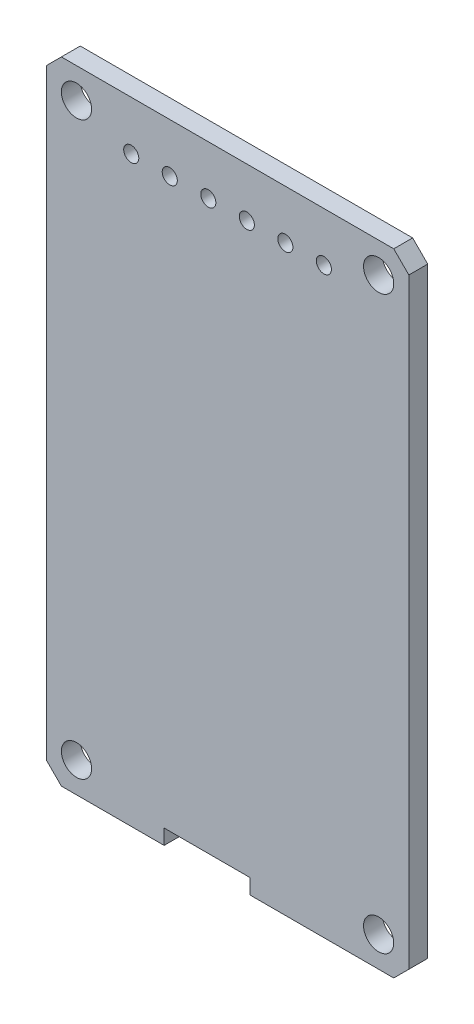
ISO-10303-21;
HEADER;
FILE_DESCRIPTION(('STEP AP214'),'2;1');
FILE_NAME('part.step','',(''),(''),'','','');
FILE_SCHEMA(('AUTOMOTIVE_DESIGN { 1 0 10303 214 1 1 1 1 }'));
ENDSEC;
DATA;
#1=APPLICATION_CONTEXT('core data for automotive mechanical design processes');
#2=APPLICATION_PROTOCOL_DEFINITION('international standard','automotive_design',2000,#1);
#3=PRODUCT_CONTEXT('',#1,'mechanical');
#4=PRODUCT('Part','Part','',(#3));
#5=PRODUCT_RELATED_PRODUCT_CATEGORY('part','',(#4));
#6=PRODUCT_DEFINITION_FORMATION('','',#4);
#7=PRODUCT_DEFINITION_CONTEXT('part definition',#1,'design');
#8=PRODUCT_DEFINITION('design','',#6,#7);
#9=PRODUCT_DEFINITION_SHAPE('','',#8);
#10=(LENGTH_UNIT() NAMED_UNIT(*) SI_UNIT(.MILLI.,.METRE.));
#11=(NAMED_UNIT(*) PLANE_ANGLE_UNIT() SI_UNIT($,.RADIAN.));
#12=(NAMED_UNIT(*) SI_UNIT($,.STERADIAN.) SOLID_ANGLE_UNIT());
#13=UNCERTAINTY_MEASURE_WITH_UNIT(LENGTH_MEASURE(1.E-05),#10,'distance_accuracy_value','');
#14=(GEOMETRIC_REPRESENTATION_CONTEXT(3) GLOBAL_UNCERTAINTY_ASSIGNED_CONTEXT((#13)) GLOBAL_UNIT_ASSIGNED_CONTEXT((#10,
#11,#12)) REPRESENTATION_CONTEXT('',''));
#15=CARTESIAN_POINT('',(0.,0.,0.));
#16=DIRECTION('',(0.,0.,1.));
#17=DIRECTION('',(1.,0.,0.));
#18=AXIS2_PLACEMENT_3D('',#15,#16,#17);
#19=CARTESIAN_POINT('',(0.,0.,0.));
#20=DIRECTION('',(0.,0.,1.));
#21=DIRECTION('',(1.,0.,0.));
#22=AXIS2_PLACEMENT_3D('',#19,#20,#21);
#23=PLANE('',#22);
#24=CARTESIAN_POINT('',(10.,2.,0.));
#25=DIRECTION('',(0.,0.,1.));
#26=DIRECTION('',(1.,0.,0.));
#27=AXIS2_PLACEMENT_3D('',#24,#25,#26);
#28=CIRCLE('',#27,1.);
#29=CARTESIAN_POINT('',(11.,2.,0.));
#30=VERTEX_POINT('',#29);
#31=EDGE_CURVE('E157',#30,#30,#28,.T.);
#32=ORIENTED_EDGE('',*,*,#31,.T.);
#33=EDGE_LOOP('',(#32));
#34=FACE_BOUND('',#33,.T.);
#35=CARTESIAN_POINT('',(1.275,38.55,0.));
#36=DIRECTION('',(0.,0.,1.));
#37=DIRECTION('',(1.,0.,0.));
#38=AXIS2_PLACEMENT_3D('',#35,#36,#37);
#39=CIRCLE('',#38,0.5);
#40=CARTESIAN_POINT('',(1.775,38.55,0.));
#41=VERTEX_POINT('',#40);
#42=EDGE_CURVE('E161',#41,#41,#39,.T.);
#43=ORIENTED_EDGE('',*,*,#42,.T.);
#44=EDGE_LOOP('',(#43));
#45=FACE_BOUND('',#44,.T.);
#46=CARTESIAN_POINT('',(-1.275,38.55,0.));
#47=DIRECTION('',(0.,0.,-1.));
#48=DIRECTION('',(-1.,0.,0.));
#49=AXIS2_PLACEMENT_3D('',#46,#47,#48);
#50=CIRCLE('',#49,0.5);
#51=CARTESIAN_POINT('',(-1.775,38.55,0.));
#52=VERTEX_POINT('',#51);
#53=EDGE_CURVE('E164',#52,#52,#50,.F.);
#54=ORIENTED_EDGE('',*,*,#53,.T.);
#55=EDGE_LOOP('',(#54));
#56=FACE_BOUND('',#55,.T.);
#57=CARTESIAN_POINT('',(-10.,2.,0.));
#58=DIRECTION('',(0.,0.,-1.));
#59=DIRECTION('',(-1.,0.,0.));
#60=AXIS2_PLACEMENT_3D('',#57,#58,#59);
#61=CIRCLE('',#60,1.);
#62=CARTESIAN_POINT('',(-11.,2.,0.));
#63=VERTEX_POINT('',#62);
#64=EDGE_CURVE('E167',#63,#63,#61,.F.);
#65=ORIENTED_EDGE('',*,*,#64,.T.);
#66=EDGE_LOOP('',(#65));
#67=FACE_BOUND('',#66,.T.);
#68=CARTESIAN_POINT('',(-10.,39.8,0.));
#69=DIRECTION('',(0.,0.,-1.));
#70=DIRECTION('',(-1.,0.,0.));
#71=AXIS2_PLACEMENT_3D('',#68,#69,#70);
#72=CIRCLE('',#71,1.);
#73=CARTESIAN_POINT('',(-11.,39.8,0.));
#74=VERTEX_POINT('',#73);
#75=EDGE_CURVE('E170',#74,#74,#72,.F.);
#76=ORIENTED_EDGE('',*,*,#75,.T.);
#77=EDGE_LOOP('',(#76));
#78=FACE_BOUND('',#77,.T.);
#79=CARTESIAN_POINT('',(-3.825,38.55,0.));
#80=DIRECTION('',(0.,0.,-1.));
#81=DIRECTION('',(-1.,0.,0.));
#82=AXIS2_PLACEMENT_3D('',#79,#80,#81);
#83=CIRCLE('',#82,0.5);
#84=CARTESIAN_POINT('',(-4.325,38.55,0.));
#85=VERTEX_POINT('',#84);
#86=EDGE_CURVE('E173',#85,#85,#83,.F.);
#87=ORIENTED_EDGE('',*,*,#86,.T.);
#88=EDGE_LOOP('',(#87));
#89=FACE_BOUND('',#88,.T.);
#90=CARTESIAN_POINT('',(-6.375,38.55,0.));
#91=DIRECTION('',(0.,0.,-1.));
#92=DIRECTION('',(-1.,0.,0.));
#93=AXIS2_PLACEMENT_3D('',#90,#91,#92);
#94=CIRCLE('',#93,0.5);
#95=CARTESIAN_POINT('',(-6.875,38.55,0.));
#96=VERTEX_POINT('',#95);
#97=EDGE_CURVE('E176',#96,#96,#94,.F.);
#98=ORIENTED_EDGE('',*,*,#97,.T.);
#99=EDGE_LOOP('',(#98));
#100=FACE_BOUND('',#99,.T.);
#101=CARTESIAN_POINT('',(3.825,38.55,0.));
#102=DIRECTION('',(0.,0.,1.));
#103=DIRECTION('',(1.,0.,0.));
#104=AXIS2_PLACEMENT_3D('',#101,#102,#103);
#105=CIRCLE('',#104,0.5);
#106=CARTESIAN_POINT('',(4.325,38.55,0.));
#107=VERTEX_POINT('',#106);
#108=EDGE_CURVE('E179',#107,#107,#105,.T.);
#109=ORIENTED_EDGE('',*,*,#108,.T.);
#110=EDGE_LOOP('',(#109));
#111=FACE_BOUND('',#110,.T.);
#112=CARTESIAN_POINT('',(10.,39.8,0.));
#113=DIRECTION('',(0.,0.,1.));
#114=DIRECTION('',(1.,0.,0.));
#115=AXIS2_PLACEMENT_3D('',#112,#113,#114);
#116=CIRCLE('',#115,1.);
#117=CARTESIAN_POINT('',(11.,39.8,0.));
#118=VERTEX_POINT('',#117);
#119=EDGE_CURVE('E181',#118,#118,#116,.T.);
#120=ORIENTED_EDGE('',*,*,#119,.T.);
#121=EDGE_LOOP('',(#120));
#122=FACE_BOUND('',#121,.T.);
#123=CARTESIAN_POINT('',(6.375,38.55,0.));
#124=DIRECTION('',(0.,0.,1.));
#125=DIRECTION('',(1.,0.,0.));
#126=AXIS2_PLACEMENT_3D('',#123,#124,#125);
#127=CIRCLE('',#126,0.5);
#128=CARTESIAN_POINT('',(6.875,38.55,0.));
#129=VERTEX_POINT('',#128);
#130=EDGE_CURVE('E20',#129,#129,#127,.T.);
#131=ORIENTED_EDGE('',*,*,#130,.T.);
#132=EDGE_LOOP('',(#131));
#133=FACE_BOUND('',#132,.T.);
#134=DIRECTION('',(1.,0.,0.));
#135=VECTOR('',#134,1.);
#136=CARTESIAN_POINT('',(1.5,1.,0.));
#137=LINE('',#136,#135);
#138=CARTESIAN_POINT('',(-4.2,1.,0.));
#139=VERTEX_POINT('',#138);
#140=CARTESIAN_POINT('',(1.5,1.,0.));
#141=VERTEX_POINT('',#140);
#142=EDGE_CURVE('E196',#139,#141,#137,.T.);
#143=ORIENTED_EDGE('',*,*,#142,.F.);
#144=DIRECTION('',(0.,1.,0.));
#145=VECTOR('',#144,1.);
#146=CARTESIAN_POINT('',(-4.2,1.,0.));
#147=LINE('',#146,#145);
#148=CARTESIAN_POINT('',(-4.2,0.,0.));
#149=VERTEX_POINT('',#148);
#150=EDGE_CURVE('E201',#149,#139,#147,.T.);
#151=ORIENTED_EDGE('',*,*,#150,.F.);
#152=DIRECTION('',(1.,0.,0.));
#153=VECTOR('',#152,1.);
#154=CARTESIAN_POINT('',(0.,0.,0.));
#155=LINE('',#154,#153);
#156=CARTESIAN_POINT('',(-11.,0.,0.));
#157=VERTEX_POINT('',#156);
#158=EDGE_CURVE('E208',#149,#157,#155,.F.);
#159=ORIENTED_EDGE('',*,*,#158,.T.);
#160=DIRECTION('',(-0.707106781186548,0.707106781186548,0.));
#161=VECTOR('',#160,1.);
#162=CARTESIAN_POINT('',(-12.,1.,0.));
#163=LINE('',#162,#161);
#164=CARTESIAN_POINT('',(-12.,1.,0.));
#165=VERTEX_POINT('',#164);
#166=EDGE_CURVE('E212',#157,#165,#163,.T.);
#167=ORIENTED_EDGE('',*,*,#166,.T.);
#168=DIRECTION('',(0.,1.,0.));
#169=VECTOR('',#168,1.);
#170=CARTESIAN_POINT('',(-12.,0.,0.));
#171=LINE('',#170,#169);
#172=CARTESIAN_POINT('',(-12.,40.8,0.));
#173=VERTEX_POINT('',#172);
#174=EDGE_CURVE('E216',#165,#173,#171,.T.);
#175=ORIENTED_EDGE('',*,*,#174,.T.);
#176=DIRECTION('',(-0.707106781186548,-0.707106781186548,0.));
#177=VECTOR('',#176,1.);
#178=CARTESIAN_POINT('',(-12.,40.8,0.));
#179=LINE('',#178,#177);
#180=CARTESIAN_POINT('',(-11.,41.8,0.));
#181=VERTEX_POINT('',#180);
#182=EDGE_CURVE('E218',#181,#173,#179,.T.);
#183=ORIENTED_EDGE('',*,*,#182,.F.);
#184=DIRECTION('',(1.,0.,0.));
#185=VECTOR('',#184,1.);
#186=CARTESIAN_POINT('',(-12.,41.8,0.));
#187=LINE('',#186,#185);
#188=CARTESIAN_POINT('',(11.,41.8,0.));
#189=VERTEX_POINT('',#188);
#190=EDGE_CURVE('E226',#181,#189,#187,.T.);
#191=ORIENTED_EDGE('',*,*,#190,.T.);
#192=DIRECTION('',(0.707106781186548,-0.707106781186548,0.));
#193=VECTOR('',#192,1.);
#194=CARTESIAN_POINT('',(12.,40.8,0.));
#195=LINE('',#194,#193);
#196=CARTESIAN_POINT('',(12.,40.8,0.));
#197=VERTEX_POINT('',#196);
#198=EDGE_CURVE('E230',#189,#197,#195,.T.);
#199=ORIENTED_EDGE('',*,*,#198,.T.);
#200=DIRECTION('',(0.,1.,0.));
#201=VECTOR('',#200,1.);
#202=CARTESIAN_POINT('',(12.,0.,0.));
#203=LINE('',#202,#201);
#204=CARTESIAN_POINT('',(12.,1.,0.));
#205=VERTEX_POINT('',#204);
#206=EDGE_CURVE('E103',#205,#197,#203,.T.);
#207=ORIENTED_EDGE('',*,*,#206,.F.);
#208=DIRECTION('',(0.707106781186548,0.707106781186548,0.));
#209=VECTOR('',#208,1.);
#210=CARTESIAN_POINT('',(12.,1.,0.));
#211=LINE('',#210,#209);
#212=CARTESIAN_POINT('',(11.,0.,0.));
#213=VERTEX_POINT('',#212);
#214=EDGE_CURVE('E118',#213,#205,#211,.T.);
#215=ORIENTED_EDGE('',*,*,#214,.F.);
#216=DIRECTION('',(1.,0.,0.));
#217=VECTOR('',#216,1.);
#218=CARTESIAN_POINT('',(0.,0.,0.));
#219=LINE('',#218,#217);
#220=CARTESIAN_POINT('',(1.5,0.,0.));
#221=VERTEX_POINT('',#220);
#222=EDGE_CURVE('E108',#213,#221,#219,.F.);
#223=ORIENTED_EDGE('',*,*,#222,.T.);
#224=DIRECTION('',(0.,1.,0.));
#225=VECTOR('',#224,1.);
#226=CARTESIAN_POINT('',(1.5,0.,0.));
#227=LINE('',#226,#225);
#228=EDGE_CURVE('E186',#141,#221,#227,.F.);
#229=ORIENTED_EDGE('',*,*,#228,.F.);
#230=EDGE_LOOP('',(#143,#151,#159,#167,#175,#183,#191,#199,#207,#215,#223,#229));
#231=FACE_BOUND('',#230,.T.);
#232=ADVANCED_FACE('F17',(#34,#45,#56,#67,#78,#89,#100,#111,#122,#133,#231),#23,.F.);
#233=CARTESIAN_POINT('',(0.,0.,0.));
#234=DIRECTION('',(0.,1.,0.));
#235=DIRECTION('',(0.,0.,1.));
#236=AXIS2_PLACEMENT_3D('',#233,#234,#235);
#237=PLANE('',#236);
#238=ORIENTED_EDGE('',*,*,#222,.F.);
#239=DIRECTION('',(0.,0.,1.));
#240=VECTOR('',#239,1.);
#241=CARTESIAN_POINT('',(11.,0.,-0.25));
#242=LINE('',#241,#240);
#243=CARTESIAN_POINT('',(11.,0.,1.25));
#244=VERTEX_POINT('',#243);
#245=EDGE_CURVE('E111',#244,#213,#242,.F.);
#246=ORIENTED_EDGE('',*,*,#245,.F.);
#247=DIRECTION('',(1.,0.,0.));
#248=VECTOR('',#247,1.);
#249=CARTESIAN_POINT('',(0.,0.,1.25));
#250=LINE('',#249,#248);
#251=CARTESIAN_POINT('',(1.5,0.,1.25));
#252=VERTEX_POINT('',#251);
#253=EDGE_CURVE('E160',#252,#244,#250,.T.);
#254=ORIENTED_EDGE('',*,*,#253,.F.);
#255=DIRECTION('',(0.,0.,1.));
#256=VECTOR('',#255,1.);
#257=CARTESIAN_POINT('',(1.5,0.,1.25));
#258=LINE('',#257,#256);
#259=EDGE_CURVE('E114',#221,#252,#258,.T.);
#260=ORIENTED_EDGE('',*,*,#259,.F.);
#261=EDGE_LOOP('',(#238,#246,#254,#260));
#262=FACE_BOUND('',#261,.T.);
#263=ADVANCED_FACE('F109',(#262),#237,.F.);
#264=CARTESIAN_POINT('',(12.,1.,-0.25));
#265=DIRECTION('',(0.707106781186548,-0.707106781186548,0.));
#266=DIRECTION('',(0.707106781186548,0.707106781186548,0.));
#267=AXIS2_PLACEMENT_3D('',#264,#265,#266);
#268=PLANE('',#267);
#269=ORIENTED_EDGE('',*,*,#214,.T.);
#270=DIRECTION('',(0.,0.,-1.));
#271=VECTOR('',#270,1.);
#272=CARTESIAN_POINT('',(12.,1.,0.));
#273=LINE('',#272,#271);
#274=CARTESIAN_POINT('',(12.,1.,1.25));
#275=VERTEX_POINT('',#274);
#276=EDGE_CURVE('E232',#275,#205,#273,.T.);
#277=ORIENTED_EDGE('',*,*,#276,.F.);
#278=DIRECTION('',(0.707106781186548,0.707106781186547,0.));
#279=VECTOR('',#278,1.);
#280=CARTESIAN_POINT('',(11.,0.,1.25));
#281=LINE('',#280,#279);
#282=EDGE_CURVE('E125',#244,#275,#281,.T.);
#283=ORIENTED_EDGE('',*,*,#282,.F.);
#284=ORIENTED_EDGE('',*,*,#245,.T.);
#285=EDGE_LOOP('',(#269,#277,#283,#284));
#286=FACE_BOUND('',#285,.T.);
#287=ADVANCED_FACE('F123',(#286),#268,.T.);
#288=CARTESIAN_POINT('',(12.,0.,0.));
#289=DIRECTION('',(1.,0.,0.));
#290=DIRECTION('',(0.,0.,-1.));
#291=AXIS2_PLACEMENT_3D('',#288,#289,#290);
#292=PLANE('',#291);
#293=DIRECTION('',(0.,1.,0.));
#294=VECTOR('',#293,1.);
#295=CARTESIAN_POINT('',(12.,0.,1.25));
#296=LINE('',#295,#294);
#297=CARTESIAN_POINT('',(12.,40.8,1.25));
#298=VERTEX_POINT('',#297);
#299=EDGE_CURVE('E249',#275,#298,#296,.T.);
#300=ORIENTED_EDGE('',*,*,#299,.F.);
#301=ORIENTED_EDGE('',*,*,#276,.T.);
#302=ORIENTED_EDGE('',*,*,#206,.T.);
#303=DIRECTION('',(0.,0.,1.));
#304=VECTOR('',#303,1.);
#305=CARTESIAN_POINT('',(12.,40.8,-0.25));
#306=LINE('',#305,#304);
#307=EDGE_CURVE('E228',#197,#298,#306,.T.);
#308=ORIENTED_EDGE('',*,*,#307,.T.);
#309=EDGE_LOOP('',(#300,#301,#302,#308));
#310=FACE_BOUND('',#309,.T.);
#311=ADVANCED_FACE('F236',(#310),#292,.T.);
#312=CARTESIAN_POINT('',(12.,40.8,-0.25));
#313=DIRECTION('',(-0.707106781186548,-0.707106781186548,0.));
#314=DIRECTION('',(0.707106781186548,-0.707106781186548,0.));
#315=AXIS2_PLACEMENT_3D('',#312,#313,#314);
#316=PLANE('',#315);
#317=ORIENTED_EDGE('',*,*,#198,.F.);
#318=DIRECTION('',(0.,0.,-1.));
#319=VECTOR('',#318,1.);
#320=CARTESIAN_POINT('',(11.,41.8,0.));
#321=LINE('',#320,#319);
#322=CARTESIAN_POINT('',(11.,41.8,1.25));
#323=VERTEX_POINT('',#322);
#324=EDGE_CURVE('E224',#189,#323,#321,.F.);
#325=ORIENTED_EDGE('',*,*,#324,.T.);
#326=DIRECTION('',(-0.707106781186547,0.707106781186547,0.));
#327=VECTOR('',#326,1.);
#328=CARTESIAN_POINT('',(12.,40.8,1.25));
#329=LINE('',#328,#327);
#330=EDGE_CURVE('E243',#298,#323,#329,.T.);
#331=ORIENTED_EDGE('',*,*,#330,.F.);
#332=ORIENTED_EDGE('',*,*,#307,.F.);
#333=EDGE_LOOP('',(#317,#325,#331,#332));
#334=FACE_BOUND('',#333,.T.);
#335=ADVANCED_FACE('F240',(#334),#316,.F.);
#336=CARTESIAN_POINT('',(-12.,41.8,0.));
#337=DIRECTION('',(0.,-1.,0.));
#338=DIRECTION('',(0.,0.,-1.));
#339=AXIS2_PLACEMENT_3D('',#336,#337,#338);
#340=PLANE('',#339);
#341=DIRECTION('',(1.,0.,0.));
#342=VECTOR('',#341,1.);
#343=CARTESIAN_POINT('',(0.,41.8,1.25));
#344=LINE('',#343,#342);
#345=CARTESIAN_POINT('',(-11.,41.8,1.25));
#346=VERTEX_POINT('',#345);
#347=EDGE_CURVE('E248',#323,#346,#344,.F.);
#348=ORIENTED_EDGE('',*,*,#347,.F.);
#349=ORIENTED_EDGE('',*,*,#324,.F.);
#350=ORIENTED_EDGE('',*,*,#190,.F.);
#351=DIRECTION('',(0.,0.,1.));
#352=VECTOR('',#351,1.);
#353=CARTESIAN_POINT('',(-11.,41.8,-0.25));
#354=LINE('',#353,#352);
#355=EDGE_CURVE('E221',#346,#181,#354,.F.);
#356=ORIENTED_EDGE('',*,*,#355,.F.);
#357=EDGE_LOOP('',(#348,#349,#350,#356));
#358=FACE_BOUND('',#357,.T.);
#359=ADVANCED_FACE('F458',(#358),#340,.F.);
#360=CARTESIAN_POINT('',(-12.,40.8,-0.25));
#361=DIRECTION('',(-0.707106781186548,0.707106781186548,0.));
#362=DIRECTION('',(-0.707106781186548,-0.707106781186548,0.));
#363=AXIS2_PLACEMENT_3D('',#360,#361,#362);
#364=PLANE('',#363);
#365=ORIENTED_EDGE('',*,*,#182,.T.);
#366=DIRECTION('',(0.,0.,-1.));
#367=VECTOR('',#366,1.);
#368=CARTESIAN_POINT('',(-12.,40.8,0.));
#369=LINE('',#368,#367);
#370=CARTESIAN_POINT('',(-12.,40.8,1.25));
#371=VERTEX_POINT('',#370);
#372=EDGE_CURVE('E214',#173,#371,#369,.F.);
#373=ORIENTED_EDGE('',*,*,#372,.T.);
#374=DIRECTION('',(-0.707106781186547,-0.707106781186547,0.));
#375=VECTOR('',#374,1.);
#376=CARTESIAN_POINT('',(-11.,41.8,1.25));
#377=LINE('',#376,#375);
#378=EDGE_CURVE('E256',#346,#371,#377,.T.);
#379=ORIENTED_EDGE('',*,*,#378,.F.);
#380=ORIENTED_EDGE('',*,*,#355,.T.);
#381=EDGE_LOOP('',(#365,#373,#379,#380));
#382=FACE_BOUND('',#381,.T.);
#383=ADVANCED_FACE('F449',(#382),#364,.T.);
#384=CARTESIAN_POINT('',(-12.,0.,0.));
#385=DIRECTION('',(1.,0.,0.));
#386=DIRECTION('',(0.,0.,-1.));
#387=AXIS2_PLACEMENT_3D('',#384,#385,#386);
#388=PLANE('',#387);
#389=DIRECTION('',(0.,1.,0.));
#390=VECTOR('',#389,1.);
#391=CARTESIAN_POINT('',(-12.,0.,1.25));
#392=LINE('',#391,#390);
#393=CARTESIAN_POINT('',(-12.,1.,1.25));
#394=VERTEX_POINT('',#393);
#395=EDGE_CURVE('E259',#371,#394,#392,.F.);
#396=ORIENTED_EDGE('',*,*,#395,.F.);
#397=ORIENTED_EDGE('',*,*,#372,.F.);
#398=ORIENTED_EDGE('',*,*,#174,.F.);
#399=DIRECTION('',(0.,0.,1.));
#400=VECTOR('',#399,1.);
#401=CARTESIAN_POINT('',(-12.,1.,-0.25));
#402=LINE('',#401,#400);
#403=EDGE_CURVE('E210',#165,#394,#402,.T.);
#404=ORIENTED_EDGE('',*,*,#403,.T.);
#405=EDGE_LOOP('',(#396,#397,#398,#404));
#406=FACE_BOUND('',#405,.T.);
#407=ADVANCED_FACE('F440',(#406),#388,.F.);
#408=CARTESIAN_POINT('',(-12.,1.,-0.25));
#409=DIRECTION('',(0.707106781186548,0.707106781186548,0.));
#410=DIRECTION('',(-0.707106781186548,0.707106781186548,0.));
#411=AXIS2_PLACEMENT_3D('',#408,#409,#410);
#412=PLANE('',#411);
#413=ORIENTED_EDGE('',*,*,#166,.F.);
#414=DIRECTION('',(0.,0.,1.));
#415=VECTOR('',#414,1.);
#416=CARTESIAN_POINT('',(-11.,0.,0.));
#417=LINE('',#416,#415);
#418=CARTESIAN_POINT('',(-11.,0.,1.25));
#419=VERTEX_POINT('',#418);
#420=EDGE_CURVE('E206',#157,#419,#417,.T.);
#421=ORIENTED_EDGE('',*,*,#420,.T.);
#422=DIRECTION('',(0.707106781186548,-0.707106781186547,0.));
#423=VECTOR('',#422,1.);
#424=CARTESIAN_POINT('',(-12.,1.,1.25));
#425=LINE('',#424,#423);
#426=EDGE_CURVE('E262',#394,#419,#425,.T.);
#427=ORIENTED_EDGE('',*,*,#426,.F.);
#428=ORIENTED_EDGE('',*,*,#403,.F.);
#429=EDGE_LOOP('',(#413,#421,#427,#428));
#430=FACE_BOUND('',#429,.T.);
#431=ADVANCED_FACE('F431',(#430),#412,.F.);
#432=CARTESIAN_POINT('',(0.,0.,0.));
#433=DIRECTION('',(0.,1.,0.));
#434=DIRECTION('',(0.,0.,1.));
#435=AXIS2_PLACEMENT_3D('',#432,#433,#434);
#436=PLANE('',#435);
#437=DIRECTION('',(1.,0.,0.));
#438=VECTOR('',#437,1.);
#439=CARTESIAN_POINT('',(0.,0.,1.25));
#440=LINE('',#439,#438);
#441=CARTESIAN_POINT('',(-4.2,0.,1.25));
#442=VERTEX_POINT('',#441);
#443=EDGE_CURVE('E265',#419,#442,#440,.T.);
#444=ORIENTED_EDGE('',*,*,#443,.F.);
#445=ORIENTED_EDGE('',*,*,#420,.F.);
#446=ORIENTED_EDGE('',*,*,#158,.F.);
#447=DIRECTION('',(0.,0.,-1.));
#448=VECTOR('',#447,1.);
#449=CARTESIAN_POINT('',(-4.2,0.,1.25));
#450=LINE('',#449,#448);
#451=EDGE_CURVE('E203',#442,#149,#450,.T.);
#452=ORIENTED_EDGE('',*,*,#451,.F.);
#453=EDGE_LOOP('',(#444,#445,#446,#452));
#454=FACE_BOUND('',#453,.T.);
#455=ADVANCED_FACE('F422',(#454),#436,.F.);
#456=CARTESIAN_POINT('',(-4.2,1.,1.25));
#457=DIRECTION('',(1.,0.,0.));
#458=DIRECTION('',(0.,0.,-1.));
#459=AXIS2_PLACEMENT_3D('',#456,#457,#458);
#460=PLANE('',#459);
#461=ORIENTED_EDGE('',*,*,#451,.T.);
#462=ORIENTED_EDGE('',*,*,#150,.T.);
#463=DIRECTION('',(0.,0.,-1.));
#464=VECTOR('',#463,1.);
#465=CARTESIAN_POINT('',(-4.2,1.,1.25));
#466=LINE('',#465,#464);
#467=CARTESIAN_POINT('',(-4.2,1.,1.25));
#468=VERTEX_POINT('',#467);
#469=EDGE_CURVE('E198',#468,#139,#466,.T.);
#470=ORIENTED_EDGE('',*,*,#469,.F.);
#471=DIRECTION('',(0.,1.,0.));
#472=VECTOR('',#471,1.);
#473=CARTESIAN_POINT('',(-4.2,0.,1.25));
#474=LINE('',#473,#472);
#475=EDGE_CURVE('E268',#442,#468,#474,.T.);
#476=ORIENTED_EDGE('',*,*,#475,.F.);
#477=EDGE_LOOP('',(#461,#462,#470,#476));
#478=FACE_BOUND('',#477,.T.);
#479=ADVANCED_FACE('F287',(#478),#460,.T.);
#480=CARTESIAN_POINT('',(1.5,1.,1.25));
#481=DIRECTION('',(0.,-1.,0.));
#482=DIRECTION('',(0.,0.,-1.));
#483=AXIS2_PLACEMENT_3D('',#480,#481,#482);
#484=PLANE('',#483);
#485=ORIENTED_EDGE('',*,*,#469,.T.);
#486=ORIENTED_EDGE('',*,*,#142,.T.);
#487=DIRECTION('',(0.,0.,1.));
#488=VECTOR('',#487,1.);
#489=CARTESIAN_POINT('',(1.5,1.,1.25));
#490=LINE('',#489,#488);
#491=CARTESIAN_POINT('',(1.5,1.,1.25));
#492=VERTEX_POINT('',#491);
#493=EDGE_CURVE('E35',#492,#141,#490,.F.);
#494=ORIENTED_EDGE('',*,*,#493,.F.);
#495=DIRECTION('',(1.,0.,0.));
#496=VECTOR('',#495,1.);
#497=CARTESIAN_POINT('',(0.,1.,1.25));
#498=LINE('',#497,#496);
#499=EDGE_CURVE('E271',#468,#492,#498,.T.);
#500=ORIENTED_EDGE('',*,*,#499,.F.);
#501=EDGE_LOOP('',(#485,#486,#494,#500));
#502=FACE_BOUND('',#501,.T.);
#503=ADVANCED_FACE('F277',(#502),#484,.T.);
#504=CARTESIAN_POINT('',(1.5,0.,1.25));
#505=DIRECTION('',(-1.,0.,0.));
#506=DIRECTION('',(0.,0.,1.));
#507=AXIS2_PLACEMENT_3D('',#504,#505,#506);
#508=PLANE('',#507);
#509=ORIENTED_EDGE('',*,*,#493,.T.);
#510=ORIENTED_EDGE('',*,*,#228,.T.);
#511=ORIENTED_EDGE('',*,*,#259,.T.);
#512=DIRECTION('',(0.,1.,0.));
#513=VECTOR('',#512,1.);
#514=CARTESIAN_POINT('',(1.5,0.,1.25));
#515=LINE('',#514,#513);
#516=EDGE_CURVE('E156',#492,#252,#515,.F.);
#517=ORIENTED_EDGE('',*,*,#516,.F.);
#518=EDGE_LOOP('',(#509,#510,#511,#517));
#519=FACE_BOUND('',#518,.T.);
#520=ADVANCED_FACE('F274',(#519),#508,.T.);
#521=CARTESIAN_POINT('',(6.375,38.55,1.25));
#522=DIRECTION('',(0.,0.,1.));
#523=DIRECTION('',(1.,0.,0.));
#524=AXIS2_PLACEMENT_3D('',#521,#522,#523);
#525=CYLINDRICAL_SURFACE('',#524,0.5);
#526=ORIENTED_EDGE('',*,*,#130,.F.);
#527=EDGE_LOOP('',(#526));
#528=FACE_BOUND('',#527,.T.);
#529=CARTESIAN_POINT('',(6.375,38.55,1.25));
#530=DIRECTION('',(0.,0.,1.));
#531=DIRECTION('',(1.,0.,0.));
#532=AXIS2_PLACEMENT_3D('',#529,#530,#531);
#533=CIRCLE('',#532,0.5);
#534=CARTESIAN_POINT('',(6.875,38.55,1.25));
#535=VERTEX_POINT('',#534);
#536=EDGE_CURVE('E153',#535,#535,#533,.F.);
#537=ORIENTED_EDGE('',*,*,#536,.F.);
#538=EDGE_LOOP('',(#537));
#539=FACE_BOUND('',#538,.T.);
#540=ADVANCED_FACE('F276',(#528,#539),#525,.F.);
#541=CARTESIAN_POINT('',(10.,39.8,1.25));
#542=DIRECTION('',(0.,0.,1.));
#543=DIRECTION('',(1.,0.,0.));
#544=AXIS2_PLACEMENT_3D('',#541,#542,#543);
#545=CYLINDRICAL_SURFACE('',#544,1.);
#546=ORIENTED_EDGE('',*,*,#119,.F.);
#547=EDGE_LOOP('',(#546));
#548=FACE_BOUND('',#547,.T.);
#549=CARTESIAN_POINT('',(10.,39.8,1.25));
#550=DIRECTION('',(0.,0.,1.));
#551=DIRECTION('',(1.,0.,0.));
#552=AXIS2_PLACEMENT_3D('',#549,#550,#551);
#553=CIRCLE('',#552,1.);
#554=CARTESIAN_POINT('',(11.,39.8,1.25));
#555=VERTEX_POINT('',#554);
#556=EDGE_CURVE('E150',#555,#555,#553,.F.);
#557=ORIENTED_EDGE('',*,*,#556,.F.);
#558=EDGE_LOOP('',(#557));
#559=FACE_BOUND('',#558,.T.);
#560=ADVANCED_FACE('F284',(#548,#559),#545,.F.);
#561=CARTESIAN_POINT('',(3.825,38.55,1.25));
#562=DIRECTION('',(0.,0.,1.));
#563=DIRECTION('',(1.,0.,0.));
#564=AXIS2_PLACEMENT_3D('',#561,#562,#563);
#565=CYLINDRICAL_SURFACE('',#564,0.5);
#566=ORIENTED_EDGE('',*,*,#108,.F.);
#567=EDGE_LOOP('',(#566));
#568=FACE_BOUND('',#567,.T.);
#569=CARTESIAN_POINT('',(3.825,38.55,1.25));
#570=DIRECTION('',(0.,0.,1.));
#571=DIRECTION('',(1.,0.,0.));
#572=AXIS2_PLACEMENT_3D('',#569,#570,#571);
#573=CIRCLE('',#572,0.5);
#574=CARTESIAN_POINT('',(4.325,38.55,1.25));
#575=VERTEX_POINT('',#574);
#576=EDGE_CURVE('E147',#575,#575,#573,.F.);
#577=ORIENTED_EDGE('',*,*,#576,.F.);
#578=EDGE_LOOP('',(#577));
#579=FACE_BOUND('',#578,.T.);
#580=ADVANCED_FACE('F323',(#568,#579),#565,.F.);
#581=CARTESIAN_POINT('',(-6.375,38.55,1.25));
#582=DIRECTION('',(0.,0.,-1.));
#583=DIRECTION('',(-1.,0.,0.));
#584=AXIS2_PLACEMENT_3D('',#581,#582,#583);
#585=CYLINDRICAL_SURFACE('',#584,0.5);
#586=ORIENTED_EDGE('',*,*,#97,.F.);
#587=EDGE_LOOP('',(#586));
#588=FACE_BOUND('',#587,.T.);
#589=CARTESIAN_POINT('',(-6.375,38.55,1.25));
#590=DIRECTION('',(0.,0.,-1.));
#591=DIRECTION('',(-1.,0.,0.));
#592=AXIS2_PLACEMENT_3D('',#589,#590,#591);
#593=CIRCLE('',#592,0.5);
#594=CARTESIAN_POINT('',(-6.875,38.55,1.25));
#595=VERTEX_POINT('',#594);
#596=EDGE_CURVE('E144',#595,#595,#593,.T.);
#597=ORIENTED_EDGE('',*,*,#596,.F.);
#598=EDGE_LOOP('',(#597));
#599=FACE_BOUND('',#598,.T.);
#600=ADVANCED_FACE('F319',(#588,#599),#585,.F.);
#601=CARTESIAN_POINT('',(-3.825,38.55,1.25));
#602=DIRECTION('',(0.,0.,-1.));
#603=DIRECTION('',(-1.,0.,0.));
#604=AXIS2_PLACEMENT_3D('',#601,#602,#603);
#605=CYLINDRICAL_SURFACE('',#604,0.5);
#606=ORIENTED_EDGE('',*,*,#86,.F.);
#607=EDGE_LOOP('',(#606));
#608=FACE_BOUND('',#607,.T.);
#609=CARTESIAN_POINT('',(-3.825,38.55,1.25));
#610=DIRECTION('',(0.,0.,-1.));
#611=DIRECTION('',(-1.,0.,0.));
#612=AXIS2_PLACEMENT_3D('',#609,#610,#611);
#613=CIRCLE('',#612,0.5);
#614=CARTESIAN_POINT('',(-4.325,38.55,1.25));
#615=VERTEX_POINT('',#614);
#616=EDGE_CURVE('E141',#615,#615,#613,.T.);
#617=ORIENTED_EDGE('',*,*,#616,.F.);
#618=EDGE_LOOP('',(#617));
#619=FACE_BOUND('',#618,.T.);
#620=ADVANCED_FACE('F315',(#608,#619),#605,.F.);
#621=CARTESIAN_POINT('',(-10.,39.8,1.25));
#622=DIRECTION('',(0.,0.,-1.));
#623=DIRECTION('',(-1.,0.,0.));
#624=AXIS2_PLACEMENT_3D('',#621,#622,#623);
#625=CYLINDRICAL_SURFACE('',#624,1.);
#626=ORIENTED_EDGE('',*,*,#75,.F.);
#627=EDGE_LOOP('',(#626));
#628=FACE_BOUND('',#627,.T.);
#629=CARTESIAN_POINT('',(-10.,39.8,1.25));
#630=DIRECTION('',(0.,0.,-1.));
#631=DIRECTION('',(-1.,0.,0.));
#632=AXIS2_PLACEMENT_3D('',#629,#630,#631);
#633=CIRCLE('',#632,1.);
#634=CARTESIAN_POINT('',(-11.,39.8,1.25));
#635=VERTEX_POINT('',#634);
#636=EDGE_CURVE('E138',#635,#635,#633,.T.);
#637=ORIENTED_EDGE('',*,*,#636,.F.);
#638=EDGE_LOOP('',(#637));
#639=FACE_BOUND('',#638,.T.);
#640=ADVANCED_FACE('F311',(#628,#639),#625,.F.);
#641=CARTESIAN_POINT('',(-10.,2.,1.25));
#642=DIRECTION('',(0.,0.,-1.));
#643=DIRECTION('',(-1.,0.,0.));
#644=AXIS2_PLACEMENT_3D('',#641,#642,#643);
#645=CYLINDRICAL_SURFACE('',#644,1.);
#646=ORIENTED_EDGE('',*,*,#64,.F.);
#647=EDGE_LOOP('',(#646));
#648=FACE_BOUND('',#647,.T.);
#649=CARTESIAN_POINT('',(-10.,2.,1.25));
#650=DIRECTION('',(0.,0.,-1.));
#651=DIRECTION('',(-1.,0.,0.));
#652=AXIS2_PLACEMENT_3D('',#649,#650,#651);
#653=CIRCLE('',#652,1.);
#654=CARTESIAN_POINT('',(-11.,2.,1.25));
#655=VERTEX_POINT('',#654);
#656=EDGE_CURVE('E135',#655,#655,#653,.T.);
#657=ORIENTED_EDGE('',*,*,#656,.F.);
#658=EDGE_LOOP('',(#657));
#659=FACE_BOUND('',#658,.T.);
#660=ADVANCED_FACE('F307',(#648,#659),#645,.F.);
#661=CARTESIAN_POINT('',(-1.275,38.55,1.25));
#662=DIRECTION('',(0.,0.,-1.));
#663=DIRECTION('',(-1.,0.,0.));
#664=AXIS2_PLACEMENT_3D('',#661,#662,#663);
#665=CYLINDRICAL_SURFACE('',#664,0.5);
#666=ORIENTED_EDGE('',*,*,#53,.F.);
#667=EDGE_LOOP('',(#666));
#668=FACE_BOUND('',#667,.T.);
#669=CARTESIAN_POINT('',(-1.275,38.55,1.25));
#670=DIRECTION('',(0.,0.,-1.));
#671=DIRECTION('',(-1.,0.,0.));
#672=AXIS2_PLACEMENT_3D('',#669,#670,#671);
#673=CIRCLE('',#672,0.5);
#674=CARTESIAN_POINT('',(-1.775,38.55,1.25));
#675=VERTEX_POINT('',#674);
#676=EDGE_CURVE('E132',#675,#675,#673,.T.);
#677=ORIENTED_EDGE('',*,*,#676,.F.);
#678=EDGE_LOOP('',(#677));
#679=FACE_BOUND('',#678,.T.);
#680=ADVANCED_FACE('F303',(#668,#679),#665,.F.);
#681=CARTESIAN_POINT('',(1.275,38.55,1.25));
#682=DIRECTION('',(0.,0.,1.));
#683=DIRECTION('',(1.,0.,0.));
#684=AXIS2_PLACEMENT_3D('',#681,#682,#683);
#685=CYLINDRICAL_SURFACE('',#684,0.5);
#686=ORIENTED_EDGE('',*,*,#42,.F.);
#687=EDGE_LOOP('',(#686));
#688=FACE_BOUND('',#687,.T.);
#689=CARTESIAN_POINT('',(1.275,38.55,1.25));
#690=DIRECTION('',(0.,0.,1.));
#691=DIRECTION('',(1.,0.,0.));
#692=AXIS2_PLACEMENT_3D('',#689,#690,#691);
#693=CIRCLE('',#692,0.5);
#694=CARTESIAN_POINT('',(1.775,38.55,1.25));
#695=VERTEX_POINT('',#694);
#696=EDGE_CURVE('E26',#695,#695,#693,.F.);
#697=ORIENTED_EDGE('',*,*,#696,.F.);
#698=EDGE_LOOP('',(#697));
#699=FACE_BOUND('',#698,.T.);
#700=ADVANCED_FACE('F296',(#688,#699),#685,.F.);
#701=CARTESIAN_POINT('',(10.,2.,1.25));
#702=DIRECTION('',(0.,0.,1.));
#703=DIRECTION('',(1.,0.,0.));
#704=AXIS2_PLACEMENT_3D('',#701,#702,#703);
#705=CYLINDRICAL_SURFACE('',#704,1.);
#706=ORIENTED_EDGE('',*,*,#31,.F.);
#707=EDGE_LOOP('',(#706));
#708=FACE_BOUND('',#707,.T.);
#709=CARTESIAN_POINT('',(10.,2.,1.25));
#710=DIRECTION('',(0.,0.,1.));
#711=DIRECTION('',(1.,0.,0.));
#712=AXIS2_PLACEMENT_3D('',#709,#710,#711);
#713=CIRCLE('',#712,1.);
#714=CARTESIAN_POINT('',(11.,2.,1.25));
#715=VERTEX_POINT('',#714);
#716=EDGE_CURVE('E11',#715,#715,#713,.F.);
#717=ORIENTED_EDGE('',*,*,#716,.F.);
#718=EDGE_LOOP('',(#717));
#719=FACE_BOUND('',#718,.T.);
#720=ADVANCED_FACE('F290',(#708,#719),#705,.F.);
#721=CARTESIAN_POINT('',(0.,0.,1.25));
#722=DIRECTION('',(0.,0.,1.));
#723=DIRECTION('',(1.,0.,0.));
#724=AXIS2_PLACEMENT_3D('',#721,#722,#723);
#725=PLANE('',#724);
#726=ORIENTED_EDGE('',*,*,#716,.T.);
#727=EDGE_LOOP('',(#726));
#728=FACE_BOUND('',#727,.T.);
#729=ORIENTED_EDGE('',*,*,#696,.T.);
#730=EDGE_LOOP('',(#729));
#731=FACE_BOUND('',#730,.T.);
#732=ORIENTED_EDGE('',*,*,#676,.T.);
#733=EDGE_LOOP('',(#732));
#734=FACE_BOUND('',#733,.T.);
#735=ORIENTED_EDGE('',*,*,#656,.T.);
#736=EDGE_LOOP('',(#735));
#737=FACE_BOUND('',#736,.T.);
#738=ORIENTED_EDGE('',*,*,#636,.T.);
#739=EDGE_LOOP('',(#738));
#740=FACE_BOUND('',#739,.T.);
#741=ORIENTED_EDGE('',*,*,#616,.T.);
#742=EDGE_LOOP('',(#741));
#743=FACE_BOUND('',#742,.T.);
#744=ORIENTED_EDGE('',*,*,#596,.T.);
#745=EDGE_LOOP('',(#744));
#746=FACE_BOUND('',#745,.T.);
#747=ORIENTED_EDGE('',*,*,#576,.T.);
#748=EDGE_LOOP('',(#747));
#749=FACE_BOUND('',#748,.T.);
#750=ORIENTED_EDGE('',*,*,#556,.T.);
#751=EDGE_LOOP('',(#750));
#752=FACE_BOUND('',#751,.T.);
#753=ORIENTED_EDGE('',*,*,#536,.T.);
#754=EDGE_LOOP('',(#753));
#755=FACE_BOUND('',#754,.T.);
#756=ORIENTED_EDGE('',*,*,#499,.T.);
#757=ORIENTED_EDGE('',*,*,#516,.T.);
#758=ORIENTED_EDGE('',*,*,#253,.T.);
#759=ORIENTED_EDGE('',*,*,#282,.T.);
#760=ORIENTED_EDGE('',*,*,#299,.T.);
#761=ORIENTED_EDGE('',*,*,#330,.T.);
#762=ORIENTED_EDGE('',*,*,#347,.T.);
#763=ORIENTED_EDGE('',*,*,#378,.T.);
#764=ORIENTED_EDGE('',*,*,#395,.T.);
#765=ORIENTED_EDGE('',*,*,#426,.T.);
#766=ORIENTED_EDGE('',*,*,#443,.T.);
#767=ORIENTED_EDGE('',*,*,#475,.T.);
#768=EDGE_LOOP('',(#756,#757,#758,#759,#760,#761,#762,#763,#764,#765,#766,#767));
#769=FACE_BOUND('',#768,.T.);
#770=ADVANCED_FACE('F252',(#728,#731,#734,#737,#740,#743,#746,#749,#752,#755,#769),#725,.T.);
#771=CLOSED_SHELL('',(#232,#263,#287,#311,#335,#359,#383,#407,#431,#455,#479,#503,#520,#540,
#560,#580,#600,#620,#640,#660,#680,#700,#720,#770));
#772=MANIFOLD_SOLID_BREP('B1',#771);
#773=ADVANCED_BREP_SHAPE_REPRESENTATION('',(#18,#772),#14);
#774=SHAPE_DEFINITION_REPRESENTATION(#9,#773);
ENDSEC;
END-ISO-10303-21;
